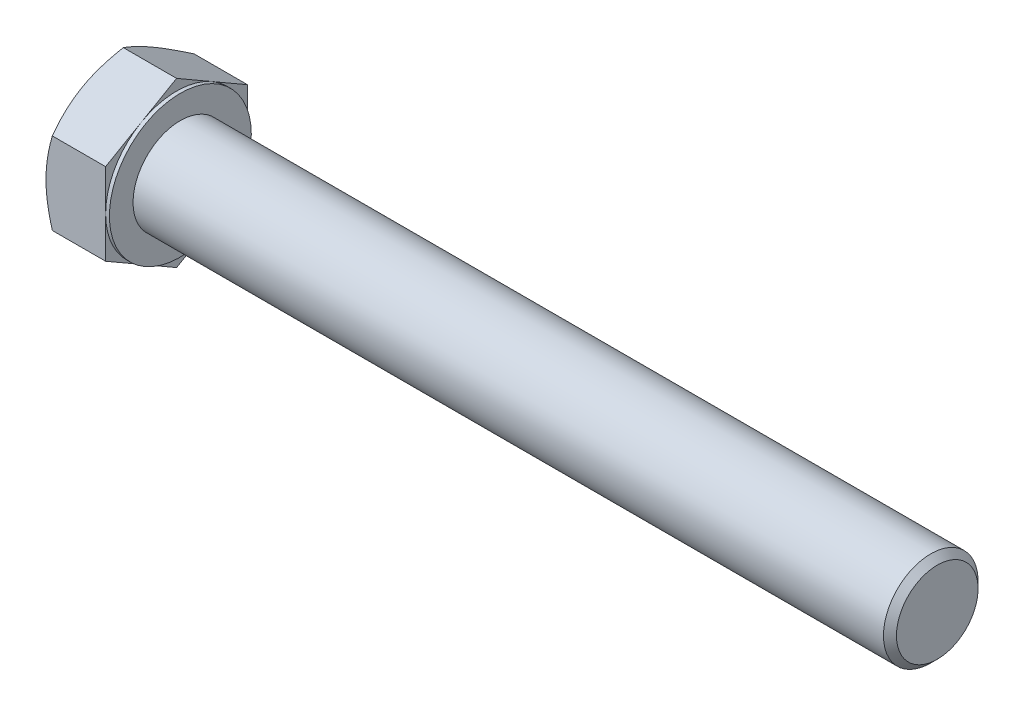
ISO-10303-21;
HEADER;
FILE_DESCRIPTION(('STEP AP214'),'2;1');
FILE_NAME('part.step','',(''),(''),'','','');
FILE_SCHEMA(('AUTOMOTIVE_DESIGN { 1 0 10303 214 1 1 1 1 }'));
ENDSEC;
DATA;
#1=APPLICATION_CONTEXT('core data for automotive mechanical design processes');
#2=APPLICATION_PROTOCOL_DEFINITION('international standard','automotive_design',2000,#1);
#3=PRODUCT_CONTEXT('',#1,'mechanical');
#4=PRODUCT('Part','Part','',(#3));
#5=PRODUCT_RELATED_PRODUCT_CATEGORY('part','',(#4));
#6=PRODUCT_DEFINITION_FORMATION('','',#4);
#7=PRODUCT_DEFINITION_CONTEXT('part definition',#1,'design');
#8=PRODUCT_DEFINITION('design','',#6,#7);
#9=PRODUCT_DEFINITION_SHAPE('','',#8);
#10=(LENGTH_UNIT() NAMED_UNIT(*) SI_UNIT(.MILLI.,.METRE.));
#11=(NAMED_UNIT(*) PLANE_ANGLE_UNIT() SI_UNIT($,.RADIAN.));
#12=(NAMED_UNIT(*) SI_UNIT($,.STERADIAN.) SOLID_ANGLE_UNIT());
#13=UNCERTAINTY_MEASURE_WITH_UNIT(LENGTH_MEASURE(1.E-05),#10,'distance_accuracy_value','');
#14=(GEOMETRIC_REPRESENTATION_CONTEXT(3) GLOBAL_UNCERTAINTY_ASSIGNED_CONTEXT((#13)) GLOBAL_UNIT_ASSIGNED_CONTEXT((#10,
#11,#12)) REPRESENTATION_CONTEXT('',''));
#15=CARTESIAN_POINT('',(0.,0.,0.));
#16=DIRECTION('',(0.,0.,1.));
#17=DIRECTION('',(1.,0.,0.));
#18=AXIS2_PLACEMENT_3D('',#15,#16,#17);
#19=CARTESIAN_POINT('',(13.4,17.3205080756888,0.));
#20=DIRECTION('',(1.,0.,0.));
#21=DIRECTION('',(0.,0.,-1.));
#22=AXIS2_PLACEMENT_3D('',#19,#20,#21);
#23=PLANE('',#22);
#24=CARTESIAN_POINT('',(13.4,0.,0.));
#25=DIRECTION('',(1.,0.,0.));
#26=DIRECTION('',(0.,0.,-1.));
#27=AXIS2_PLACEMENT_3D('',#24,#25,#26);
#28=CIRCLE('',#27,10.);
#29=CARTESIAN_POINT('',(13.4,0.,-10.));
#30=VERTEX_POINT('',#29);
#31=EDGE_CURVE('E300',#30,#30,#28,.F.);
#32=ORIENTED_EDGE('',*,*,#31,.T.);
#33=EDGE_LOOP('',(#32));
#34=FACE_BOUND('',#33,.T.);
#35=CARTESIAN_POINT('',(13.4,0.,0.));
#36=DIRECTION('',(1.,0.,0.));
#37=DIRECTION('',(0.,0.,-1.));
#38=AXIS2_PLACEMENT_3D('',#35,#36,#37);
#39=CIRCLE('',#38,15.);
#40=CARTESIAN_POINT('',(13.4,0.,-15.));
#41=VERTEX_POINT('',#40);
#42=EDGE_CURVE('E327',#41,#41,#39,.T.);
#43=ORIENTED_EDGE('',*,*,#42,.T.);
#44=EDGE_LOOP('',(#43));
#45=FACE_BOUND('',#44,.T.);
#46=ADVANCED_FACE('F41',(#34,#45),#23,.T.);
#47=CARTESIAN_POINT('',(0.,0.,0.));
#48=DIRECTION('',(-1.,0.,0.));
#49=DIRECTION('',(0.,0.,1.));
#50=AXIS2_PLACEMENT_3D('',#47,#48,#49);
#51=CYLINDRICAL_SURFACE('',#50,10.);
#52=ORIENTED_EDGE('',*,*,#31,.F.);
#53=EDGE_LOOP('',(#52));
#54=FACE_BOUND('',#53,.T.);
#55=CARTESIAN_POINT('',(172.026,0.,0.));
#56=DIRECTION('',(-1.,0.,0.));
#57=DIRECTION('',(0.,0.,1.));
#58=AXIS2_PLACEMENT_3D('',#55,#56,#57);
#59=CIRCLE('',#58,10.);
#60=CARTESIAN_POINT('',(172.026,0.,10.));
#61=VERTEX_POINT('',#60);
#62=EDGE_CURVE('E295',#61,#61,#59,.T.);
#63=ORIENTED_EDGE('',*,*,#62,.T.);
#64=EDGE_LOOP('',(#63));
#65=FACE_BOUND('',#64,.T.);
#66=ADVANCED_FACE('F268',(#54,#65),#51,.T.);
#67=CARTESIAN_POINT('',(173.4,0.,0.));
#68=DIRECTION('',(-1.,0.,0.));
#69=DIRECTION('',(0.,0.,1.));
#70=AXIS2_PLACEMENT_3D('',#67,#68,#69);
#71=CONICAL_SURFACE('',#70,8.626,0.785398163397453);
#72=ORIENTED_EDGE('',*,*,#62,.F.);
#73=EDGE_LOOP('',(#72));
#74=FACE_BOUND('',#73,.T.);
#75=CARTESIAN_POINT('',(173.4,0.,0.));
#76=DIRECTION('',(-1.,0.,0.));
#77=DIRECTION('',(0.,0.,1.));
#78=AXIS2_PLACEMENT_3D('',#75,#76,#77);
#79=CIRCLE('',#78,8.626);
#80=CARTESIAN_POINT('',(173.4,0.,8.626));
#81=VERTEX_POINT('',#80);
#82=EDGE_CURVE('E292',#81,#81,#79,.T.);
#83=ORIENTED_EDGE('',*,*,#82,.T.);
#84=EDGE_LOOP('',(#83));
#85=FACE_BOUND('',#84,.T.);
#86=ADVANCED_FACE('F273',(#74,#85),#71,.T.);
#87=CARTESIAN_POINT('',(173.4,0.,0.));
#88=DIRECTION('',(-1.,0.,0.));
#89=DIRECTION('',(0.,0.,1.));
#90=AXIS2_PLACEMENT_3D('',#87,#88,#89);
#91=PLANE('',#90);
#92=ORIENTED_EDGE('',*,*,#82,.F.);
#93=EDGE_LOOP('',(#92));
#94=FACE_BOUND('',#93,.T.);
#95=ADVANCED_FACE('F280',(#94),#91,.F.);
#96=CARTESIAN_POINT('',(12.6,15.,0.));
#97=DIRECTION('',(1.,0.,0.));
#98=DIRECTION('',(0.,0.,-1.));
#99=AXIS2_PLACEMENT_3D('',#96,#97,#98);
#100=PLANE('',#99);
#101=DIRECTION('',(0.,0.500000000000001,0.866025403784438));
#102=VECTOR('',#101,1.);
#103=CARTESIAN_POINT('',(12.6,8.66025403784438,-15.));
#104=LINE('',#103,#102);
#105=CARTESIAN_POINT('',(12.6,8.66025403784438,-15.));
#106=VERTEX_POINT('',#105);
#107=CARTESIAN_POINT('',(12.6,12.9903810567666,-7.50000000000002));
#108=VERTEX_POINT('',#107);
#109=EDGE_CURVE('E182',#106,#108,#104,.T.);
#110=ORIENTED_EDGE('',*,*,#109,.T.);
#111=CARTESIAN_POINT('',(12.6,0.,0.));
#112=DIRECTION('',(-1.,0.,0.));
#113=DIRECTION('',(0.,0.,1.));
#114=AXIS2_PLACEMENT_3D('',#111,#112,#113);
#115=CIRCLE('',#114,15.);
#116=CARTESIAN_POINT('',(12.6,0.,-15.));
#117=VERTEX_POINT('',#116);
#118=EDGE_CURVE('E58',#108,#117,#115,.T.);
#119=ORIENTED_EDGE('',*,*,#118,.T.);
#120=DIRECTION('',(0.,1.,0.));
#121=VECTOR('',#120,1.);
#122=CARTESIAN_POINT('',(12.6,8.66025403784438,-15.));
#123=LINE('',#122,#121);
#124=EDGE_CURVE('E46',#117,#106,#123,.T.);
#125=ORIENTED_EDGE('',*,*,#124,.T.);
#126=EDGE_LOOP('',(#110,#119,#125));
#127=FACE_BOUND('',#126,.T.);
#128=ADVANCED_FACE('F283',(#127),#100,.T.);
#129=CARTESIAN_POINT('',(12.6,17.3205080756888,0.));
#130=VERTEX_POINT('',#129);
#131=EDGE_CURVE('E179',#108,#130,#104,.T.);
#132=ORIENTED_EDGE('',*,*,#131,.T.);
#133=DIRECTION('',(0.,-0.500000000000001,0.866025403784438));
#134=VECTOR('',#133,1.);
#135=CARTESIAN_POINT('',(12.6,17.3205080756888,0.));
#136=LINE('',#135,#134);
#137=CARTESIAN_POINT('',(12.6,12.9903810567666,7.50000000000001));
#138=VERTEX_POINT('',#137);
#139=EDGE_CURVE('E178',#130,#138,#136,.T.);
#140=ORIENTED_EDGE('',*,*,#139,.T.);
#141=EDGE_CURVE('E163',#138,#108,#115,.T.);
#142=ORIENTED_EDGE('',*,*,#141,.T.);
#143=EDGE_LOOP('',(#132,#140,#142));
#144=FACE_BOUND('',#143,.T.);
#145=ADVANCED_FACE('F288',(#144),#100,.T.);
#146=CARTESIAN_POINT('',(12.6,8.66025403784438,15.));
#147=VERTEX_POINT('',#146);
#148=EDGE_CURVE('E140',#138,#147,#136,.T.);
#149=ORIENTED_EDGE('',*,*,#148,.T.);
#150=DIRECTION('',(0.,-1.,0.));
#151=VECTOR('',#150,1.);
#152=CARTESIAN_POINT('',(12.6,8.66025403784438,15.));
#153=LINE('',#152,#151);
#154=CARTESIAN_POINT('',(12.6,0.,15.));
#155=VERTEX_POINT('',#154);
#156=EDGE_CURVE('E134',#147,#155,#153,.T.);
#157=ORIENTED_EDGE('',*,*,#156,.T.);
#158=EDGE_CURVE('E138',#155,#138,#115,.T.);
#159=ORIENTED_EDGE('',*,*,#158,.T.);
#160=EDGE_LOOP('',(#149,#157,#159));
#161=FACE_BOUND('',#160,.T.);
#162=ADVANCED_FACE('F136',(#161),#100,.T.);
#163=CARTESIAN_POINT('',(12.6,-8.66025403784439,15.));
#164=VERTEX_POINT('',#163);
#165=EDGE_CURVE('E145',#155,#164,#153,.T.);
#166=ORIENTED_EDGE('',*,*,#165,.T.);
#167=DIRECTION('',(0.,-0.500000000000001,-0.866025403784438));
#168=VECTOR('',#167,1.);
#169=CARTESIAN_POINT('',(12.6,-17.3205080756888,0.));
#170=LINE('',#169,#168);
#171=CARTESIAN_POINT('',(12.6,-12.9903810567666,7.50000000000001));
#172=VERTEX_POINT('',#171);
#173=EDGE_CURVE('E152',#164,#172,#170,.T.);
#174=ORIENTED_EDGE('',*,*,#173,.T.);
#175=EDGE_CURVE('E149',#172,#155,#115,.T.);
#176=ORIENTED_EDGE('',*,*,#175,.T.);
#177=EDGE_LOOP('',(#166,#174,#176));
#178=FACE_BOUND('',#177,.T.);
#179=ADVANCED_FACE('F150',(#178),#100,.T.);
#180=CARTESIAN_POINT('',(12.6,-17.3205080756888,0.));
#181=VERTEX_POINT('',#180);
#182=EDGE_CURVE('E172',#172,#181,#170,.T.);
#183=ORIENTED_EDGE('',*,*,#182,.T.);
#184=DIRECTION('',(0.,0.5,-0.866025403784439));
#185=VECTOR('',#184,1.);
#186=CARTESIAN_POINT('',(12.6,-8.6602540378444,-15.));
#187=LINE('',#186,#185);
#188=CARTESIAN_POINT('',(12.6,-12.9903810567666,-7.5));
#189=VERTEX_POINT('',#188);
#190=EDGE_CURVE('E386',#181,#189,#187,.T.);
#191=ORIENTED_EDGE('',*,*,#190,.T.);
#192=EDGE_CURVE('E157',#189,#172,#115,.T.);
#193=ORIENTED_EDGE('',*,*,#192,.T.);
#194=EDGE_LOOP('',(#183,#191,#193));
#195=FACE_BOUND('',#194,.T.);
#196=ADVANCED_FACE('F393',(#195),#100,.T.);
#197=CARTESIAN_POINT('',(12.6,-8.6602540378444,-15.));
#198=VERTEX_POINT('',#197);
#199=EDGE_CURVE('E165',#189,#198,#187,.T.);
#200=ORIENTED_EDGE('',*,*,#199,.T.);
#201=EDGE_CURVE('E11',#198,#117,#123,.T.);
#202=ORIENTED_EDGE('',*,*,#201,.T.);
#203=EDGE_CURVE('E381',#117,#189,#115,.T.);
#204=ORIENTED_EDGE('',*,*,#203,.T.);
#205=EDGE_LOOP('',(#200,#202,#204));
#206=FACE_BOUND('',#205,.T.);
#207=ADVANCED_FACE('F289',(#206),#100,.T.);
#208=CARTESIAN_POINT('',(0.,0.,0.));
#209=DIRECTION('',(-1.,0.,0.));
#210=DIRECTION('',(0.,0.,1.));
#211=AXIS2_PLACEMENT_3D('',#208,#209,#210);
#212=CYLINDRICAL_SURFACE('',#211,15.);
#213=ORIENTED_EDGE('',*,*,#118,.F.);
#214=ORIENTED_EDGE('',*,*,#141,.F.);
#215=ORIENTED_EDGE('',*,*,#158,.F.);
#216=ORIENTED_EDGE('',*,*,#175,.F.);
#217=ORIENTED_EDGE('',*,*,#192,.F.);
#218=ORIENTED_EDGE('',*,*,#203,.F.);
#219=EDGE_LOOP('',(#213,#214,#215,#216,#217,#218));
#220=FACE_BOUND('',#219,.T.);
#221=ORIENTED_EDGE('',*,*,#42,.F.);
#222=EDGE_LOOP('',(#221));
#223=FACE_BOUND('',#222,.T.);
#224=ADVANCED_FACE('F160',(#220,#223),#212,.T.);
#225=CARTESIAN_POINT('',(0.,17.3205080756888,0.));
#226=DIRECTION('',(1.,0.,0.));
#227=DIRECTION('',(0.,0.,-1.));
#228=AXIS2_PLACEMENT_3D('',#225,#226,#227);
#229=PLANE('',#228);
#230=CARTESIAN_POINT('',(0.,0.,0.));
#231=DIRECTION('',(1.,0.,0.));
#232=DIRECTION('',(0.,0.,-1.));
#233=AXIS2_PLACEMENT_3D('',#230,#231,#232);
#234=CIRCLE('',#233,15.);
#235=CARTESIAN_POINT('',(0.,0.,-15.));
#236=VERTEX_POINT('',#235);
#237=CARTESIAN_POINT('',(0.,12.9903810567666,-7.50000000000001));
#238=VERTEX_POINT('',#237);
#239=EDGE_CURVE('E326',#236,#238,#234,.T.);
#240=ORIENTED_EDGE('',*,*,#239,.F.);
#241=CARTESIAN_POINT('',(0.,-12.9903810567666,-7.5));
#242=VERTEX_POINT('',#241);
#243=EDGE_CURVE('E322',#242,#236,#234,.T.);
#244=ORIENTED_EDGE('',*,*,#243,.F.);
#245=CARTESIAN_POINT('',(0.,-12.9903810567666,7.50000000000001));
#246=VERTEX_POINT('',#245);
#247=EDGE_CURVE('E325',#246,#242,#234,.T.);
#248=ORIENTED_EDGE('',*,*,#247,.F.);
#249=CARTESIAN_POINT('',(0.,0.,15.));
#250=VERTEX_POINT('',#249);
#251=EDGE_CURVE('E339',#250,#246,#234,.T.);
#252=ORIENTED_EDGE('',*,*,#251,.F.);
#253=CARTESIAN_POINT('',(0.,0.,0.));
#254=DIRECTION('',(-1.,0.,0.));
#255=DIRECTION('',(0.,0.,1.));
#256=AXIS2_PLACEMENT_3D('',#253,#254,#255);
#257=CIRCLE('',#256,15.);
#258=CARTESIAN_POINT('',(0.,12.9903810567666,7.50000000000001));
#259=VERTEX_POINT('',#258);
#260=EDGE_CURVE('E183',#250,#259,#257,.T.);
#261=ORIENTED_EDGE('',*,*,#260,.T.);
#262=EDGE_CURVE('E333',#238,#259,#234,.T.);
#263=ORIENTED_EDGE('',*,*,#262,.F.);
#264=EDGE_LOOP('',(#240,#244,#248,#252,#261,#263));
#265=FACE_BOUND('',#264,.T.);
#266=ADVANCED_FACE('F216',(#265),#229,.F.);
#267=CARTESIAN_POINT('',(0.,0.,0.));
#268=DIRECTION('',(1.,0.,0.));
#269=DIRECTION('',(0.,0.,-1.));
#270=AXIS2_PLACEMENT_3D('',#267,#268,#269);
#271=CONICAL_SURFACE('',#270,15.,1.0471975511966);
#272=CARTESIAN_POINT('',(1.33981262948893,8.66013856779054,15.0002));
#273=CARTESIAN_POINT('',(1.22992178974393,8.85048754762016,14.6705058957662));
#274=CARTESIAN_POINT('',(1.12501758932861,9.04157899075113,14.3395258073717));
#275=CARTESIAN_POINT('',(0.926568581943098,9.42529420558399,13.674911559644));
#276=CARTESIAN_POINT('',(0.833027511049488,9.61791845919701,13.3412765656162));
#277=CARTESIAN_POINT('',(0.658562147609857,10.0050715628708,12.6707077197453));
#278=CARTESIAN_POINT('',(0.577667706602187,10.199603800782,12.333767999973));
#279=CARTESIAN_POINT('',(0.430232643422044,10.5900200401078,11.6575472373606));
#280=CARTESIAN_POINT('',(0.363691202381327,10.7859039637477,11.3182663292305));
#281=CARTESIAN_POINT('',(0.247792374696309,11.1740042831265,10.6460568576327));
#282=CARTESIAN_POINT('',(0.198051383436667,11.3661918659643,10.3131781995737));
#283=CARTESIAN_POINT('',(0.114646749003609,11.7514476718676,9.6458955698383));
#284=CARTESIAN_POINT('',(0.0809834152900886,11.9445159118115,9.31149156892751));
#285=CARTESIAN_POINT('',(0.030584075708086,12.3309767189539,8.64212181582285));
#286=CARTESIAN_POINT('',(0.013827954958051,12.5243686259132,8.30715720719665));
#287=CARTESIAN_POINT('',(-0.00239660617302113,12.9113309584608,7.636918786609));
#288=CARTESIAN_POINT('',(-0.00186558072757736,13.1049013783481,7.30164498452176));
#289=CARTESIAN_POINT('',(0.0152766129981701,13.4667798342773,6.6748531126878));
#290=CARTESIAN_POINT('',(0.0297968460490156,13.6351136593857,6.38329037496757));
#291=CARTESIAN_POINT('',(0.0716371404224124,13.9713941024471,5.80083556199352));
#292=CARTESIAN_POINT('',(0.0989581071094783,14.1393406921673,5.50994353564011));
#293=CARTESIAN_POINT('',(0.165923511998907,14.4747554417509,4.92898814775338));
#294=CARTESIAN_POINT('',(0.205578128270664,14.6422230907662,4.63892567103482));
#295=CARTESIAN_POINT('',(0.296515103017906,14.9763732703289,4.06016058267396));
#296=CARTESIAN_POINT('',(0.347798251969261,15.1430557467157,3.77145806484047));
#297=CARTESIAN_POINT('',(0.520386864747111,15.6490296475801,2.89508556123959));
#298=CARTESIAN_POINT('',(0.658901178256933,15.9868558579429,2.30995340076274));
#299=CARTESIAN_POINT('',(0.973271968475216,16.6574708916881,1.14841408999664));
#300=CARTESIAN_POINT('',(1.14905461461788,16.9902683011192,0.571992068234583));
#301=CARTESIAN_POINT('',(1.33981262948894,17.3206235457426,-0.000200000000001147));
#302=B_SPLINE_CURVE_WITH_KNOTS('',3,(#272,#273,#274,#275,#276,#277,#278,#279,#280,#281,#282,
#283,#284,#285,#286,#287,#288,#289,#290,#291,#292,#293,#294,#295,#296,#297,#298,#299,#300,#301),
.UNSPECIFIED.,.F.,.F.,(4,2,2,2,2,2,2,2,2,2,2,2,2,2,4),(0.,1.18875411504163,2.37789802800057,
3.56980778300394,4.76164951910135,5.92407379683758,7.08652044780811,8.24758247406078,
9.40860862348376,10.4193068498566,11.4300765712312,12.4416826308653,13.4533574773408,
15.5211962051185,17.5849760846241),.UNSPECIFIED.);
#303=CARTESIAN_POINT('',(1.33974596215561,17.3205080756888,0.));
#304=VERTEX_POINT('',#303);
#305=EDGE_CURVE('E236',#259,#304,#302,.T.);
#306=ORIENTED_EDGE('',*,*,#305,.T.);
#307=CARTESIAN_POINT('',(1.33981262948894,17.3206235457426,0.00019999999999964));
#308=CARTESIAN_POINT('',(1.22992178974394,17.130274565913,-0.329494104233801));
#309=CARTESIAN_POINT('',(1.12501758932861,16.939183122782,-0.660474192628301));
#310=CARTESIAN_POINT('',(0.926568581943107,16.5554679079492,-1.32508844035602));
#311=CARTESIAN_POINT('',(0.833027511049497,16.3628436543362,-1.6587234343838));
#312=CARTESIAN_POINT('',(0.658562147609864,15.9756905506624,-2.32929228025473));
#313=CARTESIAN_POINT('',(0.577667706602193,15.7811583127512,-2.66623200002701));
#314=CARTESIAN_POINT('',(0.430232643422049,15.3907420734253,-3.34245276263938));
#315=CARTESIAN_POINT('',(0.363691202381332,15.1948581497855,-3.68173367076951));
#316=CARTESIAN_POINT('',(0.247792374696313,14.8067578304067,-4.35394314236732));
#317=CARTESIAN_POINT('',(0.19805138343667,14.6145702475688,-4.68682180042634));
#318=CARTESIAN_POINT('',(0.114646749003611,14.2293144416656,-5.3541044301617));
#319=CARTESIAN_POINT('',(0.0809834152900895,14.0362462017216,-5.68850843107249));
#320=CARTESIAN_POINT('',(0.030584075708086,13.6497853945792,-6.35787818417715));
#321=CARTESIAN_POINT('',(0.013827954958051,13.4563934876199,-6.69284279280335));
#322=CARTESIAN_POINT('',(-0.00239660617302218,13.0694311550724,-7.363081213391));
#323=CARTESIAN_POINT('',(-0.00186558072757955,12.8758607351851,-7.69835501547824));
#324=CARTESIAN_POINT('',(0.0152766129981677,12.5139822792559,-8.3251468873122));
#325=CARTESIAN_POINT('',(0.0297968460490139,12.3456484541475,-8.61670962503243));
#326=CARTESIAN_POINT('',(0.0716371404224101,12.0093680110861,-9.19916443800648));
#327=CARTESIAN_POINT('',(0.0989581071094747,11.8414214213658,-9.49005646435989));
#328=CARTESIAN_POINT('',(0.165923511998903,11.5060066717823,-10.0710118522466));
#329=CARTESIAN_POINT('',(0.20557812827066,11.338539022767,-10.3610743289652));
#330=CARTESIAN_POINT('',(0.296515103017902,11.0043888432043,-10.939839417326));
#331=CARTESIAN_POINT('',(0.347798251969257,10.8377063668174,-11.2285419351595));
#332=CARTESIAN_POINT('',(0.520386864747105,10.3317324659531,-12.1049144387604));
#333=CARTESIAN_POINT('',(0.658901178256927,9.99390625559024,-12.6900465992373));
#334=CARTESIAN_POINT('',(0.973271968475207,9.32329122184509,-13.8515859100034));
#335=CARTESIAN_POINT('',(1.14905461461787,8.99049381241394,-14.4280079317654));
#336=CARTESIAN_POINT('',(1.33981262948893,8.66013856779054,-15.0002));
#337=B_SPLINE_CURVE_WITH_KNOTS('',3,(#307,#308,#309,#310,#311,#312,#313,#314,#315,#316,#317,
#318,#319,#320,#321,#322,#323,#324,#325,#326,#327,#328,#329,#330,#331,#332,#333,#334,#335,#336),
.UNSPECIFIED.,.F.,.F.,(4,2,2,2,2,2,2,2,2,2,2,2,2,2,4),(0.,1.18875411504163,2.37789802800057,
3.56980778300395,4.76164951910136,5.92407379683759,7.08652044780812,8.24758247406078,
9.40860862348377,10.4193068498566,11.4300765712312,12.4416826308653,13.4533574773408,
15.5211962051185,17.5849760846241),.UNSPECIFIED.);
#338=EDGE_CURVE('E66',#304,#238,#337,.T.);
#339=ORIENTED_EDGE('',*,*,#338,.T.);
#340=ORIENTED_EDGE('',*,*,#262,.T.);
#341=EDGE_LOOP('',(#306,#339,#340));
#342=FACE_BOUND('',#341,.T.);
#343=ADVANCED_FACE('F403',(#342),#271,.T.);
#344=CARTESIAN_POINT('',(7.37312634142275,-23.3710902432644,15.));
#345=CARTESIAN_POINT('',(7.21375262239755,-23.0430760696959,15.));
#346=CARTESIAN_POINT('',(7.0551654406587,-22.7146799177878,15.));
#347=CARTESIAN_POINT('',(6.739742069922,-22.0570439860333,15.));
#348=CARTESIAN_POINT('',(6.58290589820194,-21.7278041979018,15.));
#349=CARTESIAN_POINT('',(6.11525014314408,-20.7386136979432,15.));
#350=CARTESIAN_POINT('',(5.80732977425763,-20.0772872007942,15.));
#351=CARTESIAN_POINT('',(5.19942693023618,-18.7466975911013,15.));
#352=CARTESIAN_POINT('',(4.89949586126698,-18.0774109369937,15.));
#353=CARTESIAN_POINT('',(4.31175828291557,-16.7335531331124,15.));
#354=CARTESIAN_POINT('',(4.02395120803105,-16.0589822315577,15.));
#355=CARTESIAN_POINT('',(3.45448123526224,-14.6812618349881,15.));
#356=CARTESIAN_POINT('',(3.17332879671135,-13.9779002519057,15.));
#357=CARTESIAN_POINT('',(2.63203971838782,-12.5629833864443,15.));
#358=CARTESIAN_POINT('',(2.37190542218014,-11.8514272004293,15.));
#359=CARTESIAN_POINT('',(1.87940642787692,-10.4203092780316,15.));
#360=CARTESIAN_POINT('',(1.64698643360295,-9.70076672348861,15.));
#361=CARTESIAN_POINT('',(1.21728875052384,-8.25129237895165,15.));
#362=CARTESIAN_POINT('',(1.02000010671889,-7.52136390453811,15.));
#363=CARTESIAN_POINT('',(0.758044011093801,-6.42057854331659,15.));
#364=CARTESIAN_POINT('',(0.676568269179389,-6.05369801830713,15.));
#365=CARTESIAN_POINT('',(0.525901265988503,-5.31741005070266,15.));
#366=CARTESIAN_POINT('',(0.456709757577167,-4.9480026590986,15.));
#367=CARTESIAN_POINT('',(0.331825651217591,-4.2069068427366,15.));
#368=CARTESIAN_POINT('',(0.276132866007175,-3.8352184496954,15.));
#369=CARTESIAN_POINT('',(0.179353464490729,-3.08994807461035,15.));
#370=CARTESIAN_POINT('',(0.138266210233162,-2.71636617599557,15.));
#371=CARTESIAN_POINT('',(0.0720349282598895,-1.9727530881515,15.));
#372=CARTESIAN_POINT('',(0.0466876247564245,-1.60274011577422,15.));
#373=CARTESIAN_POINT('',(0.011669016537045,-0.861974178810341,15.));
#374=CARTESIAN_POINT('',(0.00199744873684855,-0.491221226747304,15.));
#375=CARTESIAN_POINT('',(-0.00143922525530726,0.250361888695025,15.));
#376=CARTESIAN_POINT('',(0.00479570859024668,0.621192052266312,15.));
#377=CARTESIAN_POINT('',(0.0330186069992567,1.3622566426628,15.));
#378=CARTESIAN_POINT('',(0.055007276307749,1.73249104209379,15.));
#379=CARTESIAN_POINT('',(0.12605129207778,2.61901692353103,15.));
#380=CARTESIAN_POINT('',(0.18239981132372,3.13473445449997,15.));
#381=CARTESIAN_POINT('',(0.322620708796106,4.16241630719729,15.));
#382=CARTESIAN_POINT('',(0.406496739416162,4.67438012165624,15.));
#383=CARTESIAN_POINT('',(0.598789077426746,5.69404144186672,15.));
#384=CARTESIAN_POINT('',(0.707224211030173,6.20173536317269,15.));
#385=CARTESIAN_POINT('',(0.945319562147971,7.21206683369576,15.));
#386=CARTESIAN_POINT('',(1.07497948319508,7.71470445343507,15.));
#387=CARTESIAN_POINT('',(1.35544197293366,8.7260300011714,15.));
#388=CARTESIAN_POINT('',(1.50664978249795,9.23460476310562,15.));
#389=CARTESIAN_POINT('',(1.82490436760149,10.2467458711939,15.));
#390=CARTESIAN_POINT('',(1.9919512486529,10.7503121839595,15.));
#391=CARTESIAN_POINT('',(2.33921280491135,11.7526813564513,15.));
#392=CARTESIAN_POINT('',(2.51942324334104,12.2514856909171,15.));
#393=CARTESIAN_POINT('',(2.89087066982044,13.2449469454003,15.));
#394=CARTESIAN_POINT('',(3.08210752223135,13.7396039163498,15.));
#395=CARTESIAN_POINT('',(3.54947439370891,14.9157121556281,15.));
#396=CARTESIAN_POINT('',(3.82985054040226,15.5954736275084,15.));
#397=CARTESIAN_POINT('',(4.40448813627646,16.9491200493053,15.));
#398=CARTESIAN_POINT('',(4.69875048827637,17.6230046137476,15.));
#399=CARTESIAN_POINT('',(5.29835231372321,18.9660045580937,15.));
#400=CARTESIAN_POINT('',(5.60369438101907,19.6351187767802,15.));
#401=CARTESIAN_POINT('',(6.22319663175735,20.9692236125686,15.));
#402=CARTESIAN_POINT('',(6.53735661587307,21.6342143224672,15.));
#403=CARTESIAN_POINT('',(7.1731911978756,22.9615174114887,15.));
#404=CARTESIAN_POINT('',(7.49487393687324,23.6238258837404,15.));
#405=CARTESIAN_POINT('',(8.14411318399649,24.9455571763282,15.));
#406=CARTESIAN_POINT('',(8.47166971887488,25.6049799835042,15.));
#407=CARTESIAN_POINT('',(9.13159579207326,26.9212980551729,15.));
#408=CARTESIAN_POINT('',(9.46396466989029,27.5781936511553,15.));
#409=CARTESIAN_POINT('',(10.1327647298128,28.8899147680427,15.));
#410=CARTESIAN_POINT('',(10.4691959281476,29.5447402806644,15.));
#411=CARTESIAN_POINT('',(11.4259204903036,31.3950227195848,15.));
#412=CARTESIAN_POINT('',(12.0502117954095,32.5884123640315,15.));
#413=CARTESIAN_POINT('',(13.3073006205493,34.9707491110887,15.));
#414=CARTESIAN_POINT('',(13.9400984568651,36.1596960464025,15.));
#415=CARTESIAN_POINT('',(15.2105565669476,38.5310463582308,15.));
#416=CARTESIAN_POINT('',(15.848200115734,39.7134587013795,15.));
#417=CARTESIAN_POINT('',(16.8084387509036,41.4849860606789,15.));
#418=CARTESIAN_POINT('',(17.1291381447726,42.0751301522637,15.));
#419=CARTESIAN_POINT('',(17.7716684887013,43.2548008793538,15.));
#420=CARTESIAN_POINT('',(18.093499437005,43.8443275158156,15.));
#421=CARTESIAN_POINT('',(18.4158306352953,44.4335805858711,15.));
#422=B_SPLINE_CURVE_WITH_KNOTS('',3,(#344,#345,#346,#347,#348,#349,#350,#351,#352,#353,#354,
#355,#356,#357,#358,#359,#360,#361,#362,#363,#364,#365,#366,#367,#368,#369,#370,#371,#372,#373,
#374,#375,#376,#377,#378,#379,#380,#381,#382,#383,#384,#385,#386,#387,#388,#389,#390,#391,#392,
#393,#394,#395,#396,#397,#398,#399,#400,#401,#402,#403,#404,#405,#406,#407,#408,#409,#410,#411,
#412,#413,#414,#415,#416,#417,#418,#419,#420,#421),.UNSPECIFIED.,.F.,.F.,(4,2,2,2,2,2,2,2,2,2,2,
2,2,2,2,2,2,2,2,2,2,2,2,2,2,2,2,2,2,2,2,2,2,2,2,2,2,2,4),(0.,1.09404536556372,2.1881015169104,
4.37653199540515,6.57669491978641,8.77675510756671,11.0489153528487,13.3213285999183,
15.5891291984257,17.8562213861602,18.9835047922636,20.1107655170493,21.2380106029203,
22.3652064460679,23.4775244996214,24.5898238850606,25.7021260702195,26.8144780174424,
28.3699800845411,29.9256886216007,31.4825937751784,33.0394771838021,34.6309007090225,
36.2223348362746,37.8132589879854,39.4041635734972,41.6098943791885,43.8157687897567,
46.0221629875906,48.2285073505644,50.4373613430439,52.6462253985176,54.854789104351,
57.0633616365132,61.1037632942179,65.1443155962395,69.1744593178455,71.1894182926914,
73.2043741418615),.UNSPECIFIED.);
#423=CARTESIAN_POINT('',(1.3397459621556,8.66025403784438,15.));
#424=VERTEX_POINT('',#423);
#425=EDGE_CURVE('E251',#250,#424,#422,.T.);
#426=ORIENTED_EDGE('',*,*,#425,.T.);
#427=EDGE_CURVE('E250',#424,#259,#302,.T.);
#428=ORIENTED_EDGE('',*,*,#427,.T.);
#429=ORIENTED_EDGE('',*,*,#260,.F.);
#430=EDGE_LOOP('',(#426,#428,#429));
#431=FACE_BOUND('',#430,.T.);
#432=ADVANCED_FACE('F401',(#431),#271,.T.);
#433=CARTESIAN_POINT('',(1.33974596215561,-8.66025403784439,15.));
#434=VERTEX_POINT('',#433);
#435=EDGE_CURVE('E296',#434,#250,#422,.T.);
#436=ORIENTED_EDGE('',*,*,#435,.T.);
#437=ORIENTED_EDGE('',*,*,#251,.T.);
#438=CARTESIAN_POINT('',(1.33981262948895,-17.3206235457426,-0.000200000000000044));
#439=CARTESIAN_POINT('',(1.22992178974395,-17.130274565913,0.3294941042338));
#440=CARTESIAN_POINT('',(1.12501758932862,-16.939183122782,0.6604741926283));
#441=CARTESIAN_POINT('',(0.926568581943113,-16.5554679079492,1.32508844035602));
#442=CARTESIAN_POINT('',(0.833027511049503,-16.3628436543362,1.6587234343838));
#443=CARTESIAN_POINT('',(0.65856214760987,-15.9756905506624,2.32929228025473));
#444=CARTESIAN_POINT('',(0.577667706602197,-15.7811583127512,2.66623200002701));
#445=CARTESIAN_POINT('',(0.430232643422053,-15.3907420734253,3.34245276263938));
#446=CARTESIAN_POINT('',(0.363691202381336,-15.1948581497855,3.68173367076951));
#447=CARTESIAN_POINT('',(0.247792374696318,-14.8067578304067,4.35394314236732));
#448=CARTESIAN_POINT('',(0.198051383436674,-14.6145702475688,4.68682180042634));
#449=CARTESIAN_POINT('',(0.114646749003615,-14.2293144416656,5.3541044301617));
#450=CARTESIAN_POINT('',(0.0809834152900943,-14.0362462017216,5.6885084310725));
#451=CARTESIAN_POINT('',(0.0305840757080918,-13.6497853945793,6.35787818417716));
#452=CARTESIAN_POINT('',(0.0138279549580573,-13.4563934876199,6.69284279280335));
#453=CARTESIAN_POINT('',(-0.00239660617301543,-13.0694311550724,7.36308121339101));
#454=CARTESIAN_POINT('',(-0.00186558072757273,-12.8758607351851,7.69835501547825));
#455=CARTESIAN_POINT('',(0.0152766129981735,-12.5139822792559,8.32514688731221));
#456=CARTESIAN_POINT('',(0.0297968460490188,-12.3456484541475,8.61670962503243));
#457=CARTESIAN_POINT('',(0.0716371404224142,-12.0093680110861,9.19916443800648));
#458=CARTESIAN_POINT('',(0.0989581071094789,-11.8414214213658,9.49005646435989));
#459=CARTESIAN_POINT('',(0.165923511998907,-11.5060066717823,10.0710118522466));
#460=CARTESIAN_POINT('',(0.205578128270665,-11.338539022767,10.3610743289652));
#461=CARTESIAN_POINT('',(0.296515103017907,-11.0043888432043,10.939839417326));
#462=CARTESIAN_POINT('',(0.347798251969261,-10.8377063668174,11.2285419351595));
#463=CARTESIAN_POINT('',(0.52038686474711,-10.3317324659531,12.1049144387604));
#464=CARTESIAN_POINT('',(0.658901178256931,-9.99390625559025,12.6900465992373));
#465=CARTESIAN_POINT('',(0.97327196847521,-9.3232912218451,13.8515859100034));
#466=CARTESIAN_POINT('',(1.14905461461787,-8.99049381241395,14.4280079317654));
#467=CARTESIAN_POINT('',(1.33981262948893,-8.66013856779055,15.0002));
#468=B_SPLINE_CURVE_WITH_KNOTS('',3,(#438,#439,#440,#441,#442,#443,#444,#445,#446,#447,#448,
#449,#450,#451,#452,#453,#454,#455,#456,#457,#458,#459,#460,#461,#462,#463,#464,#465,#466,#467),
.UNSPECIFIED.,.F.,.F.,(4,2,2,2,2,2,2,2,2,2,2,2,2,2,4),(0.,1.18875411504163,2.37789802800057,
3.56980778300395,4.76164951910136,5.92407379683759,7.08652044780812,8.24758247406078,
9.40860862348377,10.4193068498566,11.4300765712312,12.4416826308653,13.4533574773408,
15.5211962051185,17.5849760846241),.UNSPECIFIED.);
#469=EDGE_CURVE('E238',#246,#434,#468,.T.);
#470=ORIENTED_EDGE('',*,*,#469,.T.);
#471=EDGE_LOOP('',(#436,#437,#470));
#472=FACE_BOUND('',#471,.T.);
#473=ADVANCED_FACE('F205',(#472),#271,.T.);
#474=CARTESIAN_POINT('',(1.33974596215562,-17.3205080756888,0.));
#475=VERTEX_POINT('',#474);
#476=EDGE_CURVE('E229',#475,#246,#468,.T.);
#477=ORIENTED_EDGE('',*,*,#476,.T.);
#478=ORIENTED_EDGE('',*,*,#247,.T.);
#479=CARTESIAN_POINT('',(1.33981262948894,-8.66013856779056,-15.0002));
#480=CARTESIAN_POINT('',(1.22992178974394,-8.85048754762018,-14.6705058957662));
#481=CARTESIAN_POINT('',(1.12501758932861,-9.04157899075115,-14.3395258073717));
#482=CARTESIAN_POINT('',(0.926568581943107,-9.42529420558401,-13.674911559644));
#483=CARTESIAN_POINT('',(0.833027511049497,-9.61791845919703,-13.3412765656162));
#484=CARTESIAN_POINT('',(0.658562147609864,-10.0050715628708,-12.6707077197453));
#485=CARTESIAN_POINT('',(0.577667706602192,-10.199603800782,-12.333767999973));
#486=CARTESIAN_POINT('',(0.430232643422049,-10.5900200401079,-11.6575472373606));
#487=CARTESIAN_POINT('',(0.363691202381333,-10.7859039637477,-11.3182663292305));
#488=CARTESIAN_POINT('',(0.247792374696317,-11.1740042831265,-10.6460568576327));
#489=CARTESIAN_POINT('',(0.198051383436675,-11.3661918659644,-10.3131781995737));
#490=CARTESIAN_POINT('',(0.114646749003616,-11.7514476718676,-9.6458955698383));
#491=CARTESIAN_POINT('',(0.0809834152900955,-11.9445159118116,-9.3114915689275));
#492=CARTESIAN_POINT('',(0.0305840757080935,-12.3309767189539,-8.64212181582285));
#493=CARTESIAN_POINT('',(0.0138279549580596,-12.5243686259133,-8.30715720719665));
#494=CARTESIAN_POINT('',(-0.00239660617301218,-12.9113309584608,-7.63691878660899));
#495=CARTESIAN_POINT('',(-0.00186558072756904,-13.1049013783481,-7.30164498452175));
#496=CARTESIAN_POINT('',(0.0152766129981778,-13.4667798342773,-6.67485311268779));
#497=CARTESIAN_POINT('',(0.0297968460490232,-13.6351136593857,-6.38329037496757));
#498=CARTESIAN_POINT('',(0.0716371404224198,-13.9713941024471,-5.80083556199352));
#499=CARTESIAN_POINT('',(0.0989581071094855,-14.1393406921673,-5.50994353564011));
#500=CARTESIAN_POINT('',(0.165923511998915,-14.4747554417509,-4.92898814775337));
#501=CARTESIAN_POINT('',(0.205578128270672,-14.6422230907662,-4.63892567103481));
#502=CARTESIAN_POINT('',(0.296515103017914,-14.9763732703289,-4.06016058267396));
#503=CARTESIAN_POINT('',(0.347798251969269,-15.1430557467158,-3.77145806484047));
#504=CARTESIAN_POINT('',(0.520386864747119,-15.6490296475801,-2.89508556123959));
#505=CARTESIAN_POINT('',(0.658901178256941,-15.9868558579429,-2.30995340076274));
#506=CARTESIAN_POINT('',(0.973271968475222,-16.6574708916881,-1.14841408999664));
#507=CARTESIAN_POINT('',(1.14905461461788,-16.9902683011192,-0.571992068234585));
#508=CARTESIAN_POINT('',(1.33981262948895,-17.3206235457426,0.000200000000000724));
#509=B_SPLINE_CURVE_WITH_KNOTS('',3,(#479,#480,#481,#482,#483,#484,#485,#486,#487,#488,#489,
#490,#491,#492,#493,#494,#495,#496,#497,#498,#499,#500,#501,#502,#503,#504,#505,#506,#507,#508),
.UNSPECIFIED.,.F.,.F.,(4,2,2,2,2,2,2,2,2,2,2,2,2,2,4),(0.,1.18875411504163,2.37789802800057,
3.56980778300395,4.76164951910136,5.92407379683759,7.08652044780812,8.24758247406078,
9.40860862348376,10.4193068498566,11.4300765712312,12.4416826308653,13.4533574773408,
15.5211962051185,17.5849760846241),.UNSPECIFIED.);
#510=EDGE_CURVE('E237',#242,#475,#509,.T.);
#511=ORIENTED_EDGE('',*,*,#510,.T.);
#512=EDGE_LOOP('',(#477,#478,#511));
#513=FACE_BOUND('',#512,.T.);
#514=ADVANCED_FACE('F350',(#513),#271,.T.);
#515=CARTESIAN_POINT('',(1.3397459621556,8.66025403784438,-15.));
#516=VERTEX_POINT('',#515);
#517=EDGE_CURVE('E239',#238,#516,#337,.T.);
#518=ORIENTED_EDGE('',*,*,#517,.T.);
#519=CARTESIAN_POINT('',(7.37312634142276,-23.3710902432644,-15.));
#520=CARTESIAN_POINT('',(7.21375262239756,-23.0430760696959,-15.));
#521=CARTESIAN_POINT('',(7.05516544065871,-22.7146799177878,-15.));
#522=CARTESIAN_POINT('',(6.73974206992201,-22.0570439860333,-15.));
#523=CARTESIAN_POINT('',(6.58290589820195,-21.7278041979018,-15.));
#524=CARTESIAN_POINT('',(6.11525014314409,-20.7386136979432,-15.));
#525=CARTESIAN_POINT('',(5.80732977425764,-20.0772872007942,-15.));
#526=CARTESIAN_POINT('',(5.19942693023619,-18.7466975911013,-15.));
#527=CARTESIAN_POINT('',(4.89949586126699,-18.0774109369937,-15.));
#528=CARTESIAN_POINT('',(4.31175828291557,-16.7335531331125,-15.));
#529=CARTESIAN_POINT('',(4.02395120803106,-16.0589822315577,-15.));
#530=CARTESIAN_POINT('',(3.45448123526225,-14.6812618349881,-15.));
#531=CARTESIAN_POINT('',(3.17332879671135,-13.9779002519057,-15.));
#532=CARTESIAN_POINT('',(2.63203971838782,-12.5629833864443,-15.));
#533=CARTESIAN_POINT('',(2.37190542218015,-11.8514272004293,-15.));
#534=CARTESIAN_POINT('',(1.87940642787693,-10.4203092780317,-15.));
#535=CARTESIAN_POINT('',(1.64698643360296,-9.70076672348863,-15.));
#536=CARTESIAN_POINT('',(1.21728875052385,-8.25129237895166,-15.));
#537=CARTESIAN_POINT('',(1.0200001067189,-7.52136390453813,-15.));
#538=CARTESIAN_POINT('',(0.758044011093805,-6.42057854331661,-15.));
#539=CARTESIAN_POINT('',(0.676568269179393,-6.05369801830714,-15.));
#540=CARTESIAN_POINT('',(0.525901265988506,-5.31741005070267,-15.));
#541=CARTESIAN_POINT('',(0.456709757577169,-4.94800265909861,-15.));
#542=CARTESIAN_POINT('',(0.331825651217594,-4.20690684273662,-15.));
#543=CARTESIAN_POINT('',(0.276132866007179,-3.83521844969542,-15.));
#544=CARTESIAN_POINT('',(0.179353464490733,-3.08994807461036,-15.));
#545=CARTESIAN_POINT('',(0.138266210233165,-2.71636617599559,-15.));
#546=CARTESIAN_POINT('',(0.0720349282598912,-1.97275308815152,-15.));
#547=CARTESIAN_POINT('',(0.0466876247564257,-1.60274011577424,-15.));
#548=CARTESIAN_POINT('',(0.0116690165370467,-0.861974178810357,-15.));
#549=CARTESIAN_POINT('',(0.00199744873685124,-0.49122122674732,-15.));
#550=CARTESIAN_POINT('',(-0.00143922525530497,0.25036188869501,-15.));
#551=CARTESIAN_POINT('',(0.00479570859024762,0.621192052266298,-15.));
#552=CARTESIAN_POINT('',(0.0330186069992569,1.36225664266279,-15.));
#553=CARTESIAN_POINT('',(0.0550072763077496,1.73249104209378,-15.));
#554=CARTESIAN_POINT('',(0.126051292077781,2.61901692353102,-15.));
#555=CARTESIAN_POINT('',(0.18239981132372,3.13473445449996,-15.));
#556=CARTESIAN_POINT('',(0.322620708796105,4.16241630719728,-15.));
#557=CARTESIAN_POINT('',(0.406496739416162,4.67438012165623,-15.));
#558=CARTESIAN_POINT('',(0.598789077426745,5.6940414418667,-15.));
#559=CARTESIAN_POINT('',(0.70722421103017,6.20173536317267,-15.));
#560=CARTESIAN_POINT('',(0.945319562147968,7.21206683369574,-15.));
#561=CARTESIAN_POINT('',(1.07497948319508,7.71470445343505,-15.));
#562=CARTESIAN_POINT('',(1.35544197293366,8.72603000117137,-15.));
#563=CARTESIAN_POINT('',(1.50664978249795,9.2346047631056,-15.));
#564=CARTESIAN_POINT('',(1.82490436760149,10.2467458711939,-15.));
#565=CARTESIAN_POINT('',(1.9919512486529,10.7503121839595,-15.));
#566=CARTESIAN_POINT('',(2.33921280491135,11.7526813564513,-15.));
#567=CARTESIAN_POINT('',(2.51942324334104,12.251485690917,-15.));
#568=CARTESIAN_POINT('',(2.89087066982043,13.2449469454003,-15.));
#569=CARTESIAN_POINT('',(3.08210752223134,13.7396039163498,-15.));
#570=CARTESIAN_POINT('',(3.5494743937089,14.9157121556281,-15.));
#571=CARTESIAN_POINT('',(3.82985054040225,15.5954736275083,-15.));
#572=CARTESIAN_POINT('',(4.40448813627646,16.9491200493053,-15.));
#573=CARTESIAN_POINT('',(4.69875048827637,17.6230046137476,-15.));
#574=CARTESIAN_POINT('',(5.2983523137232,18.9660045580937,-15.));
#575=CARTESIAN_POINT('',(5.60369438101906,19.6351187767802,-15.));
#576=CARTESIAN_POINT('',(6.22319663175734,20.9692236125686,-15.));
#577=CARTESIAN_POINT('',(6.53735661587307,21.6342143224672,-15.));
#578=CARTESIAN_POINT('',(7.1731911978756,22.9615174114887,-15.));
#579=CARTESIAN_POINT('',(7.49487393687323,23.6238258837404,-15.));
#580=CARTESIAN_POINT('',(8.14411318399649,24.9455571763282,-15.));
#581=CARTESIAN_POINT('',(8.47166971887488,25.6049799835042,-15.));
#582=CARTESIAN_POINT('',(9.13159579207326,26.9212980551729,-15.));
#583=CARTESIAN_POINT('',(9.46396466989029,27.5781936511553,-15.));
#584=CARTESIAN_POINT('',(10.1327647298128,28.8899147680427,-15.));
#585=CARTESIAN_POINT('',(10.4691959281476,29.5447402806644,-15.));
#586=CARTESIAN_POINT('',(11.4259204903036,31.3950227195848,-15.));
#587=CARTESIAN_POINT('',(12.0502117954095,32.5884123640315,-15.));
#588=CARTESIAN_POINT('',(13.3073006205493,34.9707491110887,-15.));
#589=CARTESIAN_POINT('',(13.9400984568651,36.1596960464025,-15.));
#590=CARTESIAN_POINT('',(15.2105565669476,38.5310463582308,-15.));
#591=CARTESIAN_POINT('',(15.848200115734,39.7134587013795,-15.));
#592=CARTESIAN_POINT('',(16.8084387509036,41.4849860606789,-15.));
#593=CARTESIAN_POINT('',(17.1291381447726,42.0751301522637,-15.));
#594=CARTESIAN_POINT('',(17.7716684887013,43.2548008793538,-15.));
#595=CARTESIAN_POINT('',(18.093499437005,43.8443275158156,-15.));
#596=CARTESIAN_POINT('',(18.4158306352953,44.4335805858711,-15.));
#597=B_SPLINE_CURVE_WITH_KNOTS('',3,(#519,#520,#521,#522,#523,#524,#525,#526,#527,#528,#529,
#530,#531,#532,#533,#534,#535,#536,#537,#538,#539,#540,#541,#542,#543,#544,#545,#546,#547,#548,
#549,#550,#551,#552,#553,#554,#555,#556,#557,#558,#559,#560,#561,#562,#563,#564,#565,#566,#567,
#568,#569,#570,#571,#572,#573,#574,#575,#576,#577,#578,#579,#580,#581,#582,#583,#584,#585,#586,
#587,#588,#589,#590,#591,#592,#593,#594,#595,#596),.UNSPECIFIED.,.F.,.F.,(4,2,2,2,2,2,2,2,2,2,2,
2,2,2,2,2,2,2,2,2,2,2,2,2,2,2,2,2,2,2,2,2,2,2,2,2,2,2,4),(0.,1.09404536556372,2.1881015169104,
4.37653199540515,6.57669491978641,8.77675510756672,11.0489153528487,13.3213285999184,
15.5891291984257,17.8562213861602,18.9835047922636,20.1107655170493,21.2380106029203,
22.3652064460679,23.4775244996214,24.5898238850606,25.7021260702195,26.8144780174424,
28.3699800845411,29.9256886216007,31.4825937751784,33.0394771838021,34.6309007090225,
36.2223348362746,37.8132589879854,39.4041635734972,41.6098943791885,43.8157687897567,
46.0221629875906,48.2285073505644,50.4373613430439,52.6462253985176,54.854789104351,
57.0633616365133,61.1037632942179,65.1443155962395,69.1744593178455,71.1894182926914,
73.2043741418615),.UNSPECIFIED.);
#598=EDGE_CURVE('E197',#516,#236,#597,.F.);
#599=ORIENTED_EDGE('',*,*,#598,.T.);
#600=ORIENTED_EDGE('',*,*,#239,.T.);
#601=EDGE_LOOP('',(#518,#599,#600));
#602=FACE_BOUND('',#601,.T.);
#603=ADVANCED_FACE('F368',(#602),#271,.T.);
#604=CARTESIAN_POINT('',(1.33974596215561,-8.6602540378444,-15.));
#605=VERTEX_POINT('',#604);
#606=EDGE_CURVE('E198',#605,#242,#509,.T.);
#607=ORIENTED_EDGE('',*,*,#606,.T.);
#608=ORIENTED_EDGE('',*,*,#243,.T.);
#609=EDGE_CURVE('E187',#236,#605,#597,.F.);
#610=ORIENTED_EDGE('',*,*,#609,.T.);
#611=EDGE_LOOP('',(#607,#608,#610));
#612=FACE_BOUND('',#611,.T.);
#613=ADVANCED_FACE('F214',(#612),#271,.T.);
#614=CARTESIAN_POINT('',(13.4,8.66025403784438,-15.));
#615=DIRECTION('',(0.,0.,1.));
#616=DIRECTION('',(0.,-1.,0.));
#617=AXIS2_PLACEMENT_3D('',#614,#615,#616);
#618=PLANE('',#617);
#619=ORIENTED_EDGE('',*,*,#201,.F.);
#620=DIRECTION('',(-1.,0.,0.));
#621=VECTOR('',#620,1.);
#622=CARTESIAN_POINT('',(13.4,-8.6602540378444,-15.));
#623=LINE('',#622,#621);
#624=EDGE_CURVE('E308',#198,#605,#623,.T.);
#625=ORIENTED_EDGE('',*,*,#624,.T.);
#626=ORIENTED_EDGE('',*,*,#609,.F.);
#627=ORIENTED_EDGE('',*,*,#598,.F.);
#628=DIRECTION('',(-1.,0.,0.));
#629=VECTOR('',#628,1.);
#630=CARTESIAN_POINT('',(13.4,8.66025403784438,-15.));
#631=LINE('',#630,#629);
#632=EDGE_CURVE('E305',#106,#516,#631,.T.);
#633=ORIENTED_EDGE('',*,*,#632,.F.);
#634=ORIENTED_EDGE('',*,*,#124,.F.);
#635=EDGE_LOOP('',(#619,#625,#626,#627,#633,#634));
#636=FACE_BOUND('',#635,.T.);
#637=ADVANCED_FACE('F209',(#636),#618,.F.);
#638=CARTESIAN_POINT('',(13.4,-8.6602540378444,-15.));
#639=DIRECTION('',(0.,0.866025403784438,0.5));
#640=DIRECTION('',(0.,-0.5,0.866025403784439));
#641=AXIS2_PLACEMENT_3D('',#638,#639,#640);
#642=PLANE('',#641);
#643=ORIENTED_EDGE('',*,*,#190,.F.);
#644=DIRECTION('',(-1.,0.,0.));
#645=VECTOR('',#644,1.);
#646=CARTESIAN_POINT('',(13.4,-17.3205080756888,0.));
#647=LINE('',#646,#645);
#648=EDGE_CURVE('E311',#181,#475,#647,.T.);
#649=ORIENTED_EDGE('',*,*,#648,.T.);
#650=ORIENTED_EDGE('',*,*,#510,.F.);
#651=ORIENTED_EDGE('',*,*,#606,.F.);
#652=ORIENTED_EDGE('',*,*,#624,.F.);
#653=ORIENTED_EDGE('',*,*,#199,.F.);
#654=EDGE_LOOP('',(#643,#649,#650,#651,#652,#653));
#655=FACE_BOUND('',#654,.T.);
#656=ADVANCED_FACE('F213',(#655),#642,.F.);
#657=CARTESIAN_POINT('',(13.4,-17.3205080756888,0.));
#658=DIRECTION('',(0.,0.866025403784438,-0.500000000000001));
#659=DIRECTION('',(0.,0.500000000000001,0.866025403784438));
#660=AXIS2_PLACEMENT_3D('',#657,#658,#659);
#661=PLANE('',#660);
#662=ORIENTED_EDGE('',*,*,#173,.F.);
#663=DIRECTION('',(-1.,0.,0.));
#664=VECTOR('',#663,1.);
#665=CARTESIAN_POINT('',(13.4,-8.66025403784439,15.));
#666=LINE('',#665,#664);
#667=EDGE_CURVE('E169',#164,#434,#666,.T.);
#668=ORIENTED_EDGE('',*,*,#667,.T.);
#669=ORIENTED_EDGE('',*,*,#469,.F.);
#670=ORIENTED_EDGE('',*,*,#476,.F.);
#671=ORIENTED_EDGE('',*,*,#648,.F.);
#672=ORIENTED_EDGE('',*,*,#182,.F.);
#673=EDGE_LOOP('',(#662,#668,#669,#670,#671,#672));
#674=FACE_BOUND('',#673,.T.);
#675=ADVANCED_FACE('F221',(#674),#661,.F.);
#676=CARTESIAN_POINT('',(13.4,8.66025403784438,15.));
#677=DIRECTION('',(0.,0.,-1.));
#678=DIRECTION('',(0.,1.,0.));
#679=AXIS2_PLACEMENT_3D('',#676,#677,#678);
#680=PLANE('',#679);
#681=ORIENTED_EDGE('',*,*,#156,.F.);
#682=DIRECTION('',(-1.,0.,0.));
#683=VECTOR('',#682,1.);
#684=CARTESIAN_POINT('',(13.4,8.66025403784438,15.));
#685=LINE('',#684,#683);
#686=EDGE_CURVE('E316',#147,#424,#685,.T.);
#687=ORIENTED_EDGE('',*,*,#686,.T.);
#688=ORIENTED_EDGE('',*,*,#425,.F.);
#689=ORIENTED_EDGE('',*,*,#435,.F.);
#690=ORIENTED_EDGE('',*,*,#667,.F.);
#691=ORIENTED_EDGE('',*,*,#165,.F.);
#692=EDGE_LOOP('',(#681,#687,#688,#689,#690,#691));
#693=FACE_BOUND('',#692,.T.);
#694=ADVANCED_FACE('F167',(#693),#680,.F.);
#695=CARTESIAN_POINT('',(13.4,17.3205080756888,0.));
#696=DIRECTION('',(0.,-0.866025403784438,-0.500000000000001));
#697=DIRECTION('',(0.,0.500000000000001,-0.866025403784438));
#698=AXIS2_PLACEMENT_3D('',#695,#696,#697);
#699=PLANE('',#698);
#700=ORIENTED_EDGE('',*,*,#139,.F.);
#701=DIRECTION('',(-1.,0.,0.));
#702=VECTOR('',#701,1.);
#703=CARTESIAN_POINT('',(13.4,17.3205080756888,0.));
#704=LINE('',#703,#702);
#705=EDGE_CURVE('E319',#130,#304,#704,.T.);
#706=ORIENTED_EDGE('',*,*,#705,.T.);
#707=ORIENTED_EDGE('',*,*,#305,.F.);
#708=ORIENTED_EDGE('',*,*,#427,.F.);
#709=ORIENTED_EDGE('',*,*,#686,.F.);
#710=ORIENTED_EDGE('',*,*,#148,.F.);
#711=EDGE_LOOP('',(#700,#706,#707,#708,#709,#710));
#712=FACE_BOUND('',#711,.T.);
#713=ADVANCED_FACE('F257',(#712),#699,.F.);
#714=CARTESIAN_POINT('',(13.4,8.66025403784438,-15.));
#715=DIRECTION('',(0.,-0.866025403784438,0.500000000000001));
#716=DIRECTION('',(0.,-0.500000000000001,-0.866025403784438));
#717=AXIS2_PLACEMENT_3D('',#714,#715,#716);
#718=PLANE('',#717);
#719=ORIENTED_EDGE('',*,*,#109,.F.);
#720=ORIENTED_EDGE('',*,*,#632,.T.);
#721=ORIENTED_EDGE('',*,*,#517,.F.);
#722=ORIENTED_EDGE('',*,*,#338,.F.);
#723=ORIENTED_EDGE('',*,*,#705,.F.);
#724=ORIENTED_EDGE('',*,*,#131,.F.);
#725=EDGE_LOOP('',(#719,#720,#721,#722,#723,#724));
#726=FACE_BOUND('',#725,.T.);
#727=ADVANCED_FACE('F43',(#726),#718,.F.);
#728=CLOSED_SHELL('',(#46,#66,#86,#95,#128,#145,#162,#179,#196,#207,#224,#266,#343,#432,#473,
#514,#603,#613,#637,#656,#675,#694,#713,#727));
#729=MANIFOLD_SOLID_BREP('B2',#728);
#730=ADVANCED_BREP_SHAPE_REPRESENTATION('',(#18,#729),#14);
#731=SHAPE_DEFINITION_REPRESENTATION(#9,#730);
ENDSEC;
END-ISO-10303-21;
